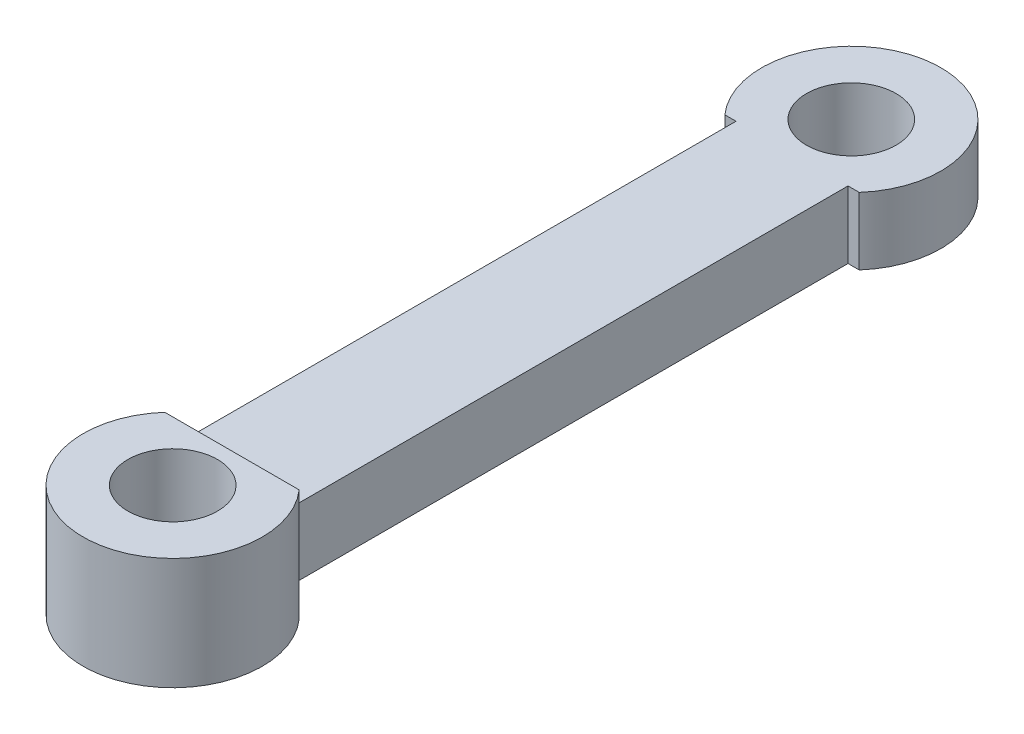
ISO-10303-21;
HEADER;
FILE_DESCRIPTION(('STEP AP214'),'2;1');
FILE_NAME('part.step','',(''),(''),'','','');
FILE_SCHEMA(('AUTOMOTIVE_DESIGN { 1 0 10303 214 1 1 1 1 }'));
ENDSEC;
DATA;
#1=APPLICATION_CONTEXT('core data for automotive mechanical design processes');
#2=APPLICATION_PROTOCOL_DEFINITION('international standard','automotive_design',2000,#1);
#3=PRODUCT_CONTEXT('',#1,'mechanical');
#4=PRODUCT('Part','Part','',(#3));
#5=PRODUCT_RELATED_PRODUCT_CATEGORY('part','',(#4));
#6=PRODUCT_DEFINITION_FORMATION('','',#4);
#7=PRODUCT_DEFINITION_CONTEXT('part definition',#1,'design');
#8=PRODUCT_DEFINITION('design','',#6,#7);
#9=PRODUCT_DEFINITION_SHAPE('','',#8);
#10=(LENGTH_UNIT() NAMED_UNIT(*) SI_UNIT(.MILLI.,.METRE.));
#11=(NAMED_UNIT(*) PLANE_ANGLE_UNIT() SI_UNIT($,.RADIAN.));
#12=(NAMED_UNIT(*) SI_UNIT($,.STERADIAN.) SOLID_ANGLE_UNIT());
#13=UNCERTAINTY_MEASURE_WITH_UNIT(LENGTH_MEASURE(1.E-05),#10,'distance_accuracy_value','');
#14=(GEOMETRIC_REPRESENTATION_CONTEXT(3) GLOBAL_UNCERTAINTY_ASSIGNED_CONTEXT((#13)) GLOBAL_UNIT_ASSIGNED_CONTEXT((#10,
#11,#12)) REPRESENTATION_CONTEXT('',''));
#15=CARTESIAN_POINT('',(0.,0.,0.));
#16=DIRECTION('',(0.,0.,1.));
#17=DIRECTION('',(1.,0.,0.));
#18=AXIS2_PLACEMENT_3D('',#15,#16,#17);
#19=CARTESIAN_POINT('',(0.,1.5,-15.1457511172285));
#20=DIRECTION('',(0.,-1.,0.));
#21=DIRECTION('',(0.,0.,-1.));
#22=AXIS2_PLACEMENT_3D('',#19,#20,#21);
#23=PLANE('',#22);
#24=DIRECTION('',(0.,0.,-1.));
#25=VECTOR('',#24,1.);
#26=CARTESIAN_POINT('',(2.49999999999999,1.5,12.4999998061639));
#27=LINE('',#26,#25);
#28=CARTESIAN_POINT('',(2.49999999999999,1.5,12.4999998061639));
#29=VERTEX_POINT('',#28);
#30=CARTESIAN_POINT('',(2.49999999999999,1.5,-12.4999998061639));
#31=VERTEX_POINT('',#30);
#32=EDGE_CURVE('E139',#29,#31,#27,.T.);
#33=ORIENTED_EDGE('',*,*,#32,.T.);
#34=DIRECTION('',(1.,0.,0.));
#35=VECTOR('',#34,1.);
#36=CARTESIAN_POINT('',(2.49999999999999,1.5,-12.4999998061639));
#37=LINE('',#36,#35);
#38=CARTESIAN_POINT('',(2.99999999999999,1.5,-12.4999998061639));
#39=VERTEX_POINT('',#38);
#40=EDGE_CURVE('E94',#31,#39,#37,.T.);
#41=ORIENTED_EDGE('',*,*,#40,.T.);
#42=CARTESIAN_POINT('',(0.,1.5,-15.1457511172285));
#43=DIRECTION('',(0.,1.,0.));
#44=DIRECTION('',(0.,0.,-1.));
#45=AXIS2_PLACEMENT_3D('',#42,#43,#44);
#46=CIRCLE('',#45,4.);
#47=CARTESIAN_POINT('',(-2.99999999999999,1.5,-12.4999998061639));
#48=VERTEX_POINT('',#47);
#49=EDGE_CURVE('E109',#39,#48,#46,.T.);
#50=ORIENTED_EDGE('',*,*,#49,.T.);
#51=DIRECTION('',(1.,0.,0.));
#52=VECTOR('',#51,1.);
#53=CARTESIAN_POINT('',(-2.49999999999999,1.5,-12.4999998061639));
#54=LINE('',#53,#52);
#55=CARTESIAN_POINT('',(-2.49999999999999,1.5,-12.4999998061639));
#56=VERTEX_POINT('',#55);
#57=EDGE_CURVE('E103',#48,#56,#54,.T.);
#58=ORIENTED_EDGE('',*,*,#57,.T.);
#59=DIRECTION('',(0.,0.,1.));
#60=VECTOR('',#59,1.);
#61=CARTESIAN_POINT('',(-2.49999999999999,1.5,12.4999998061639));
#62=LINE('',#61,#60);
#63=CARTESIAN_POINT('',(-2.49999999999999,1.5,12.4999998061639));
#64=VERTEX_POINT('',#63);
#65=EDGE_CURVE('E106',#56,#64,#62,.T.);
#66=ORIENTED_EDGE('',*,*,#65,.T.);
#67=DIRECTION('',(1.,0.,0.));
#68=VECTOR('',#67,1.);
#69=CARTESIAN_POINT('',(-2.49999999999999,1.5,12.4999998061639));
#70=LINE('',#69,#68);
#71=EDGE_CURVE('E58',#64,#29,#70,.T.);
#72=ORIENTED_EDGE('',*,*,#71,.T.);
#73=EDGE_LOOP('',(#33,#41,#50,#58,#66,#72));
#74=FACE_BOUND('',#73,.T.);
#75=CARTESIAN_POINT('',(0.,1.5,-15.1457511172285));
#76=DIRECTION('',(0.,1.,0.));
#77=DIRECTION('',(0.,0.,1.));
#78=AXIS2_PLACEMENT_3D('',#75,#76,#77);
#79=CIRCLE('',#78,2.);
#80=CARTESIAN_POINT('',(0.,1.5,-13.1457511172285));
#81=VERTEX_POINT('',#80);
#82=EDGE_CURVE('E129',#81,#81,#79,.T.);
#83=ORIENTED_EDGE('',*,*,#82,.F.);
#84=EDGE_LOOP('',(#83));
#85=FACE_BOUND('',#84,.T.);
#86=ADVANCED_FACE('F41',(#74,#85),#23,.F.);
#87=CARTESIAN_POINT('',(0.,-1.5,-15.1457511172285));
#88=DIRECTION('',(0.,-1.,0.));
#89=DIRECTION('',(0.,0.,-1.));
#90=AXIS2_PLACEMENT_3D('',#87,#88,#89);
#91=PLANE('',#90);
#92=DIRECTION('',(0.,0.,-1.));
#93=VECTOR('',#92,1.);
#94=CARTESIAN_POINT('',(2.49999999999999,-1.5,12.4999998061639));
#95=LINE('',#94,#93);
#96=CARTESIAN_POINT('',(2.49999999999999,-1.5,12.4999998061639));
#97=VERTEX_POINT('',#96);
#98=CARTESIAN_POINT('',(2.49999999999999,-1.5,-12.4999998061639));
#99=VERTEX_POINT('',#98);
#100=EDGE_CURVE('E126',#97,#99,#95,.T.);
#101=ORIENTED_EDGE('',*,*,#100,.F.);
#102=DIRECTION('',(1.,0.,0.));
#103=VECTOR('',#102,1.);
#104=CARTESIAN_POINT('',(-2.49999999999999,-1.5,12.4999998061639));
#105=LINE('',#104,#103);
#106=CARTESIAN_POINT('',(-2.49999999999999,-1.5,12.4999998061639));
#107=VERTEX_POINT('',#106);
#108=EDGE_CURVE('E136',#107,#97,#105,.T.);
#109=ORIENTED_EDGE('',*,*,#108,.F.);
#110=DIRECTION('',(0.,0.,1.));
#111=VECTOR('',#110,1.);
#112=CARTESIAN_POINT('',(-2.49999999999999,-1.5,12.4999998061639));
#113=LINE('',#112,#111);
#114=CARTESIAN_POINT('',(-2.49999999999999,-1.5,-12.4999998061639));
#115=VERTEX_POINT('',#114);
#116=EDGE_CURVE('E134',#115,#107,#113,.T.);
#117=ORIENTED_EDGE('',*,*,#116,.F.);
#118=DIRECTION('',(1.,0.,0.));
#119=VECTOR('',#118,1.);
#120=CARTESIAN_POINT('',(-2.49999999999999,-1.5,-12.4999998061639));
#121=LINE('',#120,#119);
#122=CARTESIAN_POINT('',(-2.99999999999999,-1.5,-12.4999998061639));
#123=VERTEX_POINT('',#122);
#124=EDGE_CURVE('E79',#123,#115,#121,.T.);
#125=ORIENTED_EDGE('',*,*,#124,.F.);
#126=CARTESIAN_POINT('',(0.,-1.5,-15.1457511172285));
#127=DIRECTION('',(0.,1.,0.));
#128=DIRECTION('',(0.,0.,-1.));
#129=AXIS2_PLACEMENT_3D('',#126,#127,#128);
#130=CIRCLE('',#129,4.);
#131=CARTESIAN_POINT('',(2.99999999999999,-1.5,-12.4999998061639));
#132=VERTEX_POINT('',#131);
#133=EDGE_CURVE('E131',#132,#123,#130,.T.);
#134=ORIENTED_EDGE('',*,*,#133,.F.);
#135=DIRECTION('',(1.,0.,0.));
#136=VECTOR('',#135,1.);
#137=CARTESIAN_POINT('',(2.49999999999999,-1.5,-12.4999998061639));
#138=LINE('',#137,#136);
#139=EDGE_CURVE('E128',#99,#132,#138,.T.);
#140=ORIENTED_EDGE('',*,*,#139,.F.);
#141=EDGE_LOOP('',(#101,#109,#117,#125,#134,#140));
#142=FACE_BOUND('',#141,.T.);
#143=CARTESIAN_POINT('',(0.,-1.5,-15.1457511172285));
#144=DIRECTION('',(0.,1.,0.));
#145=DIRECTION('',(0.,0.,1.));
#146=AXIS2_PLACEMENT_3D('',#143,#144,#145);
#147=CIRCLE('',#146,2.);
#148=CARTESIAN_POINT('',(0.,-1.5,-13.1457511172285));
#149=VERTEX_POINT('',#148);
#150=EDGE_CURVE('E191',#149,#149,#147,.T.);
#151=ORIENTED_EDGE('',*,*,#150,.T.);
#152=EDGE_LOOP('',(#151));
#153=FACE_BOUND('',#152,.T.);
#154=ADVANCED_FACE('F147',(#142,#153),#91,.T.);
#155=CARTESIAN_POINT('',(2.49999999999999,1.5,12.4999998061639));
#156=DIRECTION('',(-1.,0.,0.));
#157=DIRECTION('',(0.,0.,1.));
#158=AXIS2_PLACEMENT_3D('',#155,#156,#157);
#159=PLANE('',#158);
#160=ORIENTED_EDGE('',*,*,#100,.T.);
#161=DIRECTION('',(0.,-1.,0.));
#162=VECTOR('',#161,1.);
#163=CARTESIAN_POINT('',(2.49999999999999,1.5,-12.4999998061639));
#164=LINE('',#163,#162);
#165=EDGE_CURVE('E11',#31,#99,#164,.T.);
#166=ORIENTED_EDGE('',*,*,#165,.F.);
#167=ORIENTED_EDGE('',*,*,#32,.F.);
#168=DIRECTION('',(0.,-1.,0.));
#169=VECTOR('',#168,1.);
#170=CARTESIAN_POINT('',(2.49999999999999,1.5,12.4999998061639));
#171=LINE('',#170,#169);
#172=EDGE_CURVE('E86',#29,#97,#171,.T.);
#173=ORIENTED_EDGE('',*,*,#172,.T.);
#174=EDGE_LOOP('',(#160,#166,#167,#173));
#175=FACE_BOUND('',#174,.T.);
#176=ADVANCED_FACE('F43',(#175),#159,.F.);
#177=CARTESIAN_POINT('',(2.49999999999999,1.5,-12.4999998061639));
#178=DIRECTION('',(0.,0.,-1.));
#179=DIRECTION('',(-1.,0.,0.));
#180=AXIS2_PLACEMENT_3D('',#177,#178,#179);
#181=PLANE('',#180);
#182=ORIENTED_EDGE('',*,*,#139,.T.);
#183=DIRECTION('',(0.,-1.,0.));
#184=VECTOR('',#183,1.);
#185=CARTESIAN_POINT('',(2.99999999999999,1.5,-12.4999998061639));
#186=LINE('',#185,#184);
#187=EDGE_CURVE('E50',#39,#132,#186,.T.);
#188=ORIENTED_EDGE('',*,*,#187,.F.);
#189=ORIENTED_EDGE('',*,*,#40,.F.);
#190=ORIENTED_EDGE('',*,*,#165,.T.);
#191=EDGE_LOOP('',(#182,#188,#189,#190));
#192=FACE_BOUND('',#191,.T.);
#193=ADVANCED_FACE('F182',(#192),#181,.F.);
#194=CARTESIAN_POINT('',(0.,1.5,-15.1457511172285));
#195=DIRECTION('',(0.,-1.,0.));
#196=DIRECTION('',(0.,0.,-1.));
#197=AXIS2_PLACEMENT_3D('',#194,#195,#196);
#198=CYLINDRICAL_SURFACE('',#197,4.);
#199=ORIENTED_EDGE('',*,*,#133,.T.);
#200=DIRECTION('',(0.,-1.,0.));
#201=VECTOR('',#200,1.);
#202=CARTESIAN_POINT('',(-2.99999999999999,1.5,-12.4999998061639));
#203=LINE('',#202,#201);
#204=EDGE_CURVE('E117',#48,#123,#203,.T.);
#205=ORIENTED_EDGE('',*,*,#204,.F.);
#206=ORIENTED_EDGE('',*,*,#49,.F.);
#207=ORIENTED_EDGE('',*,*,#187,.T.);
#208=EDGE_LOOP('',(#199,#205,#206,#207));
#209=FACE_BOUND('',#208,.T.);
#210=ADVANCED_FACE('F145',(#209),#198,.T.);
#211=CARTESIAN_POINT('',(-2.49999999999999,1.5,-12.4999998061639));
#212=DIRECTION('',(0.,0.,-1.));
#213=DIRECTION('',(-1.,0.,0.));
#214=AXIS2_PLACEMENT_3D('',#211,#212,#213);
#215=PLANE('',#214);
#216=ORIENTED_EDGE('',*,*,#124,.T.);
#217=DIRECTION('',(0.,-1.,0.));
#218=VECTOR('',#217,1.);
#219=CARTESIAN_POINT('',(-2.49999999999999,1.5,-12.4999998061639));
#220=LINE('',#219,#218);
#221=EDGE_CURVE('E112',#56,#115,#220,.T.);
#222=ORIENTED_EDGE('',*,*,#221,.F.);
#223=ORIENTED_EDGE('',*,*,#57,.F.);
#224=ORIENTED_EDGE('',*,*,#204,.T.);
#225=EDGE_LOOP('',(#216,#222,#223,#224));
#226=FACE_BOUND('',#225,.T.);
#227=ADVANCED_FACE('F113',(#226),#215,.F.);
#228=CARTESIAN_POINT('',(-2.49999999999999,1.5,12.4999998061639));
#229=DIRECTION('',(1.,0.,0.));
#230=DIRECTION('',(0.,0.,-1.));
#231=AXIS2_PLACEMENT_3D('',#228,#229,#230);
#232=PLANE('',#231);
#233=ORIENTED_EDGE('',*,*,#116,.T.);
#234=DIRECTION('',(0.,-1.,0.));
#235=VECTOR('',#234,1.);
#236=CARTESIAN_POINT('',(-2.49999999999999,1.5,12.4999998061639));
#237=LINE('',#236,#235);
#238=EDGE_CURVE('E118',#64,#107,#237,.T.);
#239=ORIENTED_EDGE('',*,*,#238,.F.);
#240=ORIENTED_EDGE('',*,*,#65,.F.);
#241=ORIENTED_EDGE('',*,*,#221,.T.);
#242=EDGE_LOOP('',(#233,#239,#240,#241));
#243=FACE_BOUND('',#242,.T.);
#244=ADVANCED_FACE('F120',(#243),#232,.F.);
#245=CARTESIAN_POINT('',(0.,1.5,-15.1457511172285));
#246=DIRECTION('',(0.,-1.,0.));
#247=DIRECTION('',(0.,0.,-1.));
#248=AXIS2_PLACEMENT_3D('',#245,#246,#247);
#249=CYLINDRICAL_SURFACE('',#248,2.);
#250=ORIENTED_EDGE('',*,*,#82,.T.);
#251=EDGE_LOOP('',(#250));
#252=FACE_BOUND('',#251,.T.);
#253=ORIENTED_EDGE('',*,*,#150,.F.);
#254=EDGE_LOOP('',(#253));
#255=FACE_BOUND('',#254,.T.);
#256=ADVANCED_FACE('F155',(#252,#255),#249,.F.);
#257=CARTESIAN_POINT('',(-2.99999999999999,2.5,12.4999998061639));
#258=DIRECTION('',(0.,0.,1.));
#259=DIRECTION('',(1.,0.,0.));
#260=AXIS2_PLACEMENT_3D('',#257,#258,#259);
#261=PLANE('',#260);
#262=DIRECTION('',(-1.,0.,0.));
#263=VECTOR('',#262,1.);
#264=CARTESIAN_POINT('',(-2.99999999999999,-2.5,12.4999998061639));
#265=LINE('',#264,#263);
#266=CARTESIAN_POINT('',(2.99999999999999,-2.5,12.4999998061639));
#267=VERTEX_POINT('',#266);
#268=CARTESIAN_POINT('',(-2.99999999999999,-2.5,12.4999998061639));
#269=VERTEX_POINT('',#268);
#270=EDGE_CURVE('E203',#267,#269,#265,.T.);
#271=ORIENTED_EDGE('',*,*,#270,.T.);
#272=DIRECTION('',(0.,-1.,0.));
#273=VECTOR('',#272,1.);
#274=CARTESIAN_POINT('',(-2.99999999999999,2.5,12.4999998061639));
#275=LINE('',#274,#273);
#276=CARTESIAN_POINT('',(-2.99999999999999,2.5,12.4999998061639));
#277=VERTEX_POINT('',#276);
#278=EDGE_CURVE('E199',#277,#269,#275,.T.);
#279=ORIENTED_EDGE('',*,*,#278,.F.);
#280=DIRECTION('',(-1.,0.,0.));
#281=VECTOR('',#280,1.);
#282=CARTESIAN_POINT('',(-2.99999999999999,2.5,12.4999998061639));
#283=LINE('',#282,#281);
#284=CARTESIAN_POINT('',(2.99999999999999,2.5,12.4999998061639));
#285=VERTEX_POINT('',#284);
#286=EDGE_CURVE('E202',#285,#277,#283,.T.);
#287=ORIENTED_EDGE('',*,*,#286,.F.);
#288=DIRECTION('',(0.,-1.,0.));
#289=VECTOR('',#288,1.);
#290=CARTESIAN_POINT('',(2.99999999999999,2.5,12.4999998061639));
#291=LINE('',#290,#289);
#292=EDGE_CURVE('E194',#285,#267,#291,.T.);
#293=ORIENTED_EDGE('',*,*,#292,.T.);
#294=EDGE_LOOP('',(#271,#279,#287,#293));
#295=FACE_BOUND('',#294,.T.);
#296=ORIENTED_EDGE('',*,*,#108,.T.);
#297=ORIENTED_EDGE('',*,*,#172,.F.);
#298=ORIENTED_EDGE('',*,*,#71,.F.);
#299=ORIENTED_EDGE('',*,*,#238,.T.);
#300=EDGE_LOOP('',(#296,#297,#298,#299));
#301=FACE_BOUND('',#300,.T.);
#302=ADVANCED_FACE('F152',(#295,#301),#261,.F.);
#303=CARTESIAN_POINT('',(0.,2.5,15.1457511172285));
#304=DIRECTION('',(0.,1.,0.));
#305=DIRECTION('',(0.,0.,1.));
#306=AXIS2_PLACEMENT_3D('',#303,#304,#305);
#307=PLANE('',#306);
#308=CARTESIAN_POINT('',(0.,2.5,15.1457511172285));
#309=DIRECTION('',(0.,1.,0.));
#310=DIRECTION('',(0.,0.,1.));
#311=AXIS2_PLACEMENT_3D('',#308,#309,#310);
#312=CIRCLE('',#311,4.);
#313=EDGE_CURVE('E205',#277,#285,#312,.T.);
#314=ORIENTED_EDGE('',*,*,#313,.T.);
#315=ORIENTED_EDGE('',*,*,#286,.T.);
#316=EDGE_LOOP('',(#314,#315));
#317=FACE_BOUND('',#316,.T.);
#318=CARTESIAN_POINT('',(0.,2.5,15.1457511172285));
#319=DIRECTION('',(0.,1.,0.));
#320=DIRECTION('',(0.,0.,1.));
#321=AXIS2_PLACEMENT_3D('',#318,#319,#320);
#322=CIRCLE('',#321,2.);
#323=CARTESIAN_POINT('',(0.,2.5,17.1457511172285));
#324=VERTEX_POINT('',#323);
#325=EDGE_CURVE('E209',#324,#324,#322,.T.);
#326=ORIENTED_EDGE('',*,*,#325,.F.);
#327=EDGE_LOOP('',(#326));
#328=FACE_BOUND('',#327,.T.);
#329=ADVANCED_FACE('F154',(#317,#328),#307,.T.);
#330=CARTESIAN_POINT('',(0.,-2.5,15.1457511172285));
#331=DIRECTION('',(0.,1.,0.));
#332=DIRECTION('',(0.,0.,1.));
#333=AXIS2_PLACEMENT_3D('',#330,#331,#332);
#334=PLANE('',#333);
#335=CARTESIAN_POINT('',(0.,-2.5,15.1457511172285));
#336=DIRECTION('',(0.,1.,0.));
#337=DIRECTION('',(0.,0.,1.));
#338=AXIS2_PLACEMENT_3D('',#335,#336,#337);
#339=CIRCLE('',#338,4.);
#340=EDGE_CURVE('E206',#269,#267,#339,.T.);
#341=ORIENTED_EDGE('',*,*,#340,.F.);
#342=ORIENTED_EDGE('',*,*,#270,.F.);
#343=EDGE_LOOP('',(#341,#342));
#344=FACE_BOUND('',#343,.T.);
#345=CARTESIAN_POINT('',(0.,-2.5,15.1457511172285));
#346=DIRECTION('',(0.,1.,0.));
#347=DIRECTION('',(0.,0.,1.));
#348=AXIS2_PLACEMENT_3D('',#345,#346,#347);
#349=CIRCLE('',#348,2.);
#350=CARTESIAN_POINT('',(0.,-2.5,17.1457511172285));
#351=VERTEX_POINT('',#350);
#352=EDGE_CURVE('E214',#351,#351,#349,.T.);
#353=ORIENTED_EDGE('',*,*,#352,.T.);
#354=EDGE_LOOP('',(#353));
#355=FACE_BOUND('',#354,.T.);
#356=ADVANCED_FACE('F162',(#344,#355),#334,.F.);
#357=CARTESIAN_POINT('',(0.,2.5,15.1457511172285));
#358=DIRECTION('',(0.,-1.,0.));
#359=DIRECTION('',(0.,0.,-1.));
#360=AXIS2_PLACEMENT_3D('',#357,#358,#359);
#361=CYLINDRICAL_SURFACE('',#360,4.);
#362=ORIENTED_EDGE('',*,*,#340,.T.);
#363=ORIENTED_EDGE('',*,*,#292,.F.);
#364=ORIENTED_EDGE('',*,*,#313,.F.);
#365=ORIENTED_EDGE('',*,*,#278,.T.);
#366=EDGE_LOOP('',(#362,#363,#364,#365));
#367=FACE_BOUND('',#366,.T.);
#368=ADVANCED_FACE('F224',(#367),#361,.T.);
#369=CARTESIAN_POINT('',(0.,2.5,15.1457511172285));
#370=DIRECTION('',(0.,-1.,0.));
#371=DIRECTION('',(0.,0.,-1.));
#372=AXIS2_PLACEMENT_3D('',#369,#370,#371);
#373=CYLINDRICAL_SURFACE('',#372,2.);
#374=ORIENTED_EDGE('',*,*,#325,.T.);
#375=EDGE_LOOP('',(#374));
#376=FACE_BOUND('',#375,.T.);
#377=ORIENTED_EDGE('',*,*,#352,.F.);
#378=EDGE_LOOP('',(#377));
#379=FACE_BOUND('',#378,.T.);
#380=ADVANCED_FACE('F220',(#376,#379),#373,.F.);
#381=CLOSED_SHELL('',(#86,#154,#176,#193,#210,#227,#244,#256,#302,#329,#356,#368,#380));
#382=MANIFOLD_SOLID_BREP('B2',#381);
#383=ADVANCED_BREP_SHAPE_REPRESENTATION('',(#18,#382),#14);
#384=SHAPE_DEFINITION_REPRESENTATION(#9,#383);
ENDSEC;
END-ISO-10303-21;
